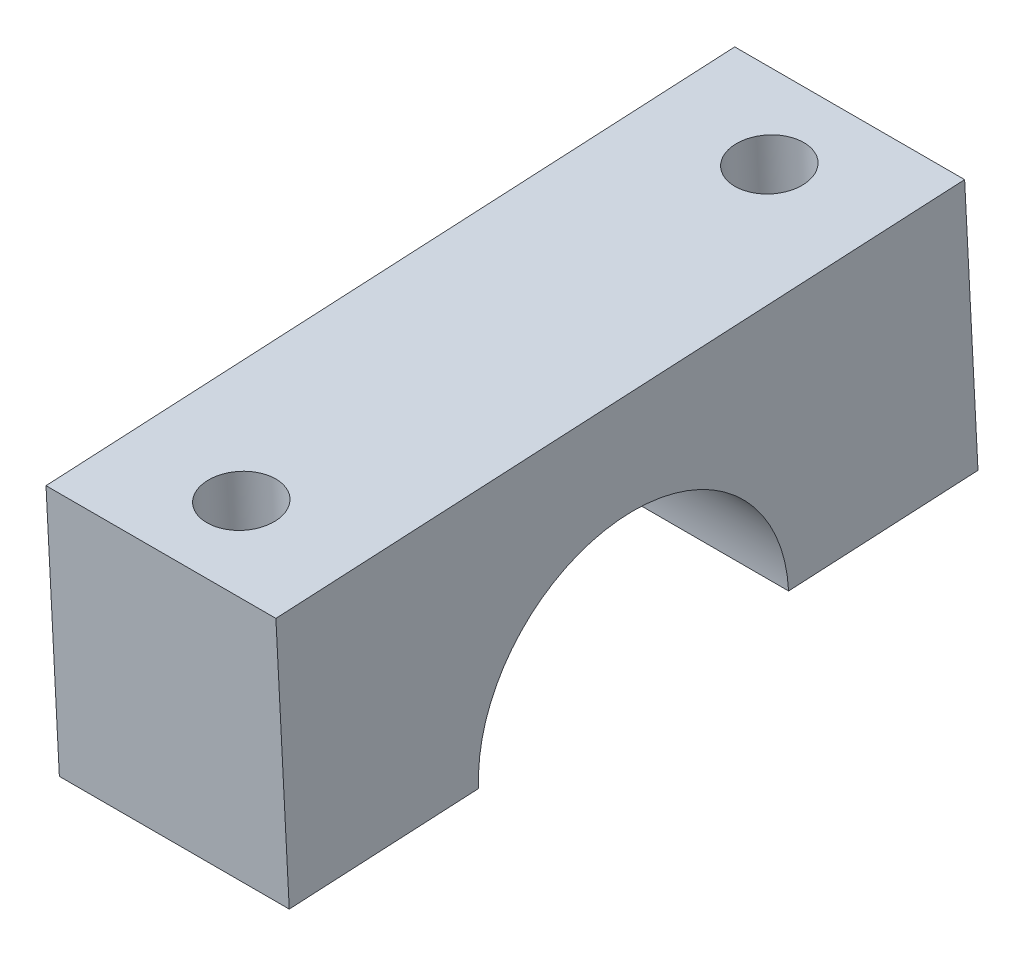
ISO-10303-21;
HEADER;
FILE_DESCRIPTION(('STEP AP214'),'2;1');
FILE_NAME('part.step','',(''),(''),'','','');
FILE_SCHEMA(('AUTOMOTIVE_DESIGN { 1 0 10303 214 1 1 1 1 }'));
ENDSEC;
DATA;
#1=APPLICATION_CONTEXT('core data for automotive mechanical design processes');
#2=APPLICATION_PROTOCOL_DEFINITION('international standard','automotive_design',2000,#1);
#3=PRODUCT_CONTEXT('',#1,'mechanical');
#4=PRODUCT('Part','Part','',(#3));
#5=PRODUCT_RELATED_PRODUCT_CATEGORY('part','',(#4));
#6=PRODUCT_DEFINITION_FORMATION('','',#4);
#7=PRODUCT_DEFINITION_CONTEXT('part definition',#1,'design');
#8=PRODUCT_DEFINITION('design','',#6,#7);
#9=PRODUCT_DEFINITION_SHAPE('','',#8);
#10=(LENGTH_UNIT() NAMED_UNIT(*) SI_UNIT(.MILLI.,.METRE.));
#11=(NAMED_UNIT(*) PLANE_ANGLE_UNIT() SI_UNIT($,.RADIAN.));
#12=(NAMED_UNIT(*) SI_UNIT($,.STERADIAN.) SOLID_ANGLE_UNIT());
#13=UNCERTAINTY_MEASURE_WITH_UNIT(LENGTH_MEASURE(1.E-05),#10,'distance_accuracy_value','');
#14=(GEOMETRIC_REPRESENTATION_CONTEXT(3) GLOBAL_UNCERTAINTY_ASSIGNED_CONTEXT((#13)) GLOBAL_UNIT_ASSIGNED_CONTEXT((#10,
#11,#12)) REPRESENTATION_CONTEXT('',''));
#15=CARTESIAN_POINT('',(0.,0.,0.));
#16=DIRECTION('',(0.,0.,1.));
#17=DIRECTION('',(1.,0.,0.));
#18=AXIS2_PLACEMENT_3D('',#15,#16,#17);
#19=CARTESIAN_POINT('',(20.,180.86438591394,3958.59296353033));
#20=DIRECTION('',(0.,0.998664984942108,0.0516550854280407));
#21=DIRECTION('',(0.,-0.0516550854280407,0.998664984942109));
#22=AXIS2_PLACEMENT_3D('',#19,#20,#21);
#23=PLANE('',#22);
#24=CARTESIAN_POINT('',(10.,180.502800315943,3965.58361842493));
#25=DIRECTION('',(0.,0.998664984942108,0.0516550854280407));
#26=DIRECTION('',(0.,-0.0516550854280407,0.998664984942109));
#27=AXIS2_PLACEMENT_3D('',#24,#25,#26);
#28=CIRCLE('',#27,2.99999999999968);
#29=CARTESIAN_POINT('',(10.,180.347835059659,3968.57961337975));
#30=VERTEX_POINT('',#29);
#31=EDGE_CURVE('E131',#30,#30,#28,.F.);
#32=ORIENTED_EDGE('',*,*,#31,.F.);
#33=EDGE_LOOP('',(#32));
#34=FACE_BOUND('',#33,.T.);
#35=DIRECTION('',(0.,0.0516550854280407,-0.998664984942108));
#36=VECTOR('',#35,1.);
#37=CARTESIAN_POINT('',(20.,180.86438591394,3958.59296353033));
#38=LINE('',#37,#36);
#39=CARTESIAN_POINT('',(20.,180.012077004377,3975.07093578188));
#40=VERTEX_POINT('',#39);
#41=CARTESIAN_POINT('',(20.,180.86438591394,3958.59296353033));
#42=VERTEX_POINT('',#41);
#43=EDGE_CURVE('E128',#40,#42,#38,.T.);
#44=ORIENTED_EDGE('',*,*,#43,.F.);
#45=DIRECTION('',(-1.,0.,0.));
#46=VECTOR('',#45,1.);
#47=CARTESIAN_POINT('',(20.,180.012077004377,3975.07093578188));
#48=LINE('',#47,#46);
#49=CARTESIAN_POINT('',(0.,180.012077004377,3975.07093578188));
#50=VERTEX_POINT('',#49);
#51=EDGE_CURVE('E117',#40,#50,#48,.T.);
#52=ORIENTED_EDGE('',*,*,#51,.T.);
#53=DIRECTION('',(0.,0.0516550854280407,-0.998664984942108));
#54=VECTOR('',#53,1.);
#55=CARTESIAN_POINT('',(0.,180.86438591394,3958.59296353033));
#56=LINE('',#55,#54);
#57=CARTESIAN_POINT('',(0.,180.86438591394,3958.59296353033));
#58=VERTEX_POINT('',#57);
#59=EDGE_CURVE('E152',#50,#58,#56,.T.);
#60=ORIENTED_EDGE('',*,*,#59,.T.);
#61=DIRECTION('',(-1.,0.,0.));
#62=VECTOR('',#61,1.);
#63=CARTESIAN_POINT('',(20.,180.86438591394,3958.59296353033));
#64=LINE('',#63,#62);
#65=EDGE_CURVE('E134',#42,#58,#64,.T.);
#66=ORIENTED_EDGE('',*,*,#65,.F.);
#67=EDGE_LOOP('',(#44,#52,#60,#66));
#68=FACE_BOUND('',#67,.T.);
#69=ADVANCED_FACE('F56',(#34,#68),#23,.F.);
#70=CARTESIAN_POINT('',(20.,177.765080788257,4018.51286262686));
#71=DIRECTION('',(0.,0.0516550854280728,-0.998664984942107));
#72=DIRECTION('',(0.,0.998664984942107,0.0516550854280728));
#73=AXIS2_PLACEMENT_3D('',#70,#71,#72);
#74=PLANE('',#73);
#75=DIRECTION('',(0.,-0.998664984942107,-0.0516550854280728));
#76=VECTOR('',#75,1.);
#77=CARTESIAN_POINT('',(0.,177.765080788257,4018.51286262686));
#78=LINE('',#77,#76);
#79=CARTESIAN_POINT('',(0.,200.251606550355,4019.67595878697));
#80=VERTEX_POINT('',#79);
#81=CARTESIAN_POINT('',(0.,177.765080788257,4018.51286262686));
#82=VERTEX_POINT('',#81);
#83=EDGE_CURVE('E125',#80,#82,#78,.T.);
#84=ORIENTED_EDGE('',*,*,#83,.T.);
#85=DIRECTION('',(-1.,0.,0.));
#86=VECTOR('',#85,1.);
#87=CARTESIAN_POINT('',(20.,177.765080788257,4018.51286262686));
#88=LINE('',#87,#86);
#89=CARTESIAN_POINT('',(20.,177.765080788257,4018.51286262686));
#90=VERTEX_POINT('',#89);
#91=EDGE_CURVE('E65',#90,#82,#88,.T.);
#92=ORIENTED_EDGE('',*,*,#91,.F.);
#93=DIRECTION('',(0.,-0.998664984942107,-0.0516550854280728));
#94=VECTOR('',#93,1.);
#95=CARTESIAN_POINT('',(20.,177.765080788257,4018.51286262686));
#96=LINE('',#95,#94);
#97=CARTESIAN_POINT('',(20.,200.251606550355,4019.67595878697));
#98=VERTEX_POINT('',#97);
#99=EDGE_CURVE('E137',#98,#90,#96,.T.);
#100=ORIENTED_EDGE('',*,*,#99,.F.);
#101=DIRECTION('',(-1.,0.,0.));
#102=VECTOR('',#101,1.);
#103=CARTESIAN_POINT('',(20.,200.251606550355,4019.67595878697));
#104=LINE('',#103,#102);
#105=EDGE_CURVE('E148',#98,#80,#104,.T.);
#106=ORIENTED_EDGE('',*,*,#105,.T.);
#107=EDGE_LOOP('',(#84,#92,#100,#106));
#108=FACE_BOUND('',#107,.T.);
#109=ADVANCED_FACE('F58',(#108),#74,.F.);
#110=CARTESIAN_POINT('',(10.,178.126666386253,4011.52220773227));
#111=DIRECTION('',(0.,0.998664984942108,0.0516550854280407));
#112=DIRECTION('',(0.,-0.0516550854280407,0.998664984942109));
#113=AXIS2_PLACEMENT_3D('',#110,#111,#112);
#114=CIRCLE('',#113,2.99999999999968);
#115=CARTESIAN_POINT('',(10.,177.971701129969,4014.5182026871));
#116=VERTEX_POINT('',#115);
#117=EDGE_CURVE('E187',#116,#116,#114,.T.);
#118=ORIENTED_EDGE('',*,*,#117,.T.);
#119=EDGE_LOOP('',(#118));
#120=FACE_BOUND('',#119,.T.);
#121=CARTESIAN_POINT('',(0.,178.61738969782,4002.03489037531));
#122=VERTEX_POINT('',#121);
#123=EDGE_CURVE('E153',#82,#122,#56,.T.);
#124=ORIENTED_EDGE('',*,*,#123,.T.);
#125=DIRECTION('',(-1.,0.,0.));
#126=VECTOR('',#125,1.);
#127=CARTESIAN_POINT('',(20.,178.61738969782,4002.03489037531));
#128=LINE('',#127,#126);
#129=CARTESIAN_POINT('',(20.,178.61738969782,4002.03489037531));
#130=VERTEX_POINT('',#129);
#131=EDGE_CURVE('E71',#122,#130,#128,.F.);
#132=ORIENTED_EDGE('',*,*,#131,.T.);
#133=EDGE_CURVE('E108',#90,#130,#38,.T.);
#134=ORIENTED_EDGE('',*,*,#133,.F.);
#135=ORIENTED_EDGE('',*,*,#91,.T.);
#136=EDGE_LOOP('',(#124,#132,#134,#135));
#137=FACE_BOUND('',#136,.T.);
#138=ADVANCED_FACE('F170',(#120,#137),#23,.F.);
#139=CARTESIAN_POINT('',(20.,203.350911676037,3959.75605969044));
#140=DIRECTION('',(0.,-0.0516550854280136,0.99866498494211));
#141=DIRECTION('',(0.,-0.99866498494211,-0.0516550854280136));
#142=AXIS2_PLACEMENT_3D('',#139,#140,#141);
#143=PLANE('',#142);
#144=DIRECTION('',(0.,0.99866498494211,0.0516550854280136));
#145=VECTOR('',#144,1.);
#146=CARTESIAN_POINT('',(0.,203.350911676037,3959.75605969044));
#147=LINE('',#146,#145);
#148=CARTESIAN_POINT('',(0.,203.350911676037,3959.75605969044));
#149=VERTEX_POINT('',#148);
#150=EDGE_CURVE('E157',#58,#149,#147,.T.);
#151=ORIENTED_EDGE('',*,*,#150,.T.);
#152=DIRECTION('',(-1.,0.,0.));
#153=VECTOR('',#152,1.);
#154=CARTESIAN_POINT('',(20.,203.350911676037,3959.75605969044));
#155=LINE('',#154,#153);
#156=CARTESIAN_POINT('',(20.,203.350911676037,3959.75605969044));
#157=VERTEX_POINT('',#156);
#158=EDGE_CURVE('E164',#157,#149,#155,.T.);
#159=ORIENTED_EDGE('',*,*,#158,.F.);
#160=DIRECTION('',(0.,0.99866498494211,0.0516550854280136));
#161=VECTOR('',#160,1.);
#162=CARTESIAN_POINT('',(20.,203.350911676037,3959.75605969044));
#163=LINE('',#162,#161);
#164=EDGE_CURVE('E141',#42,#157,#163,.T.);
#165=ORIENTED_EDGE('',*,*,#164,.F.);
#166=ORIENTED_EDGE('',*,*,#65,.T.);
#167=EDGE_LOOP('',(#151,#159,#165,#166));
#168=FACE_BOUND('',#167,.T.);
#169=ADVANCED_FACE('F219',(#168),#143,.F.);
#170=CARTESIAN_POINT('',(20.,200.251606550355,4019.67595878697));
#171=DIRECTION('',(0.,-0.998664984942109,-0.0516550854280405));
#172=DIRECTION('',(0.,0.0516550854280405,-0.998664984942109));
#173=AXIS2_PLACEMENT_3D('',#170,#171,#172);
#174=PLANE('',#173);
#175=CARTESIAN_POINT('',(10.,200.613192148351,4012.68530389238));
#176=DIRECTION('',(0.,-0.998664984942109,-0.0516550854280461));
#177=DIRECTION('',(0.,0.051655085428046,-0.998664984942108));
#178=AXIS2_PLACEMENT_3D('',#175,#176,#177);
#179=CIRCLE('',#178,2.99999999999968);
#180=CARTESIAN_POINT('',(10.,200.768157404635,4009.68930893755));
#181=VERTEX_POINT('',#180);
#182=EDGE_CURVE('E191',#181,#181,#179,.T.);
#183=ORIENTED_EDGE('',*,*,#182,.T.);
#184=EDGE_LOOP('',(#183));
#185=FACE_BOUND('',#184,.T.);
#186=CARTESIAN_POINT('',(10.,202.989326078041,3966.74671458504));
#187=DIRECTION('',(0.,0.998664984942109,0.0516550854280405));
#188=DIRECTION('',(0.,-0.0516550854280405,0.998664984942109));
#189=AXIS2_PLACEMENT_3D('',#186,#187,#188);
#190=CIRCLE('',#189,2.99999999999968);
#191=CARTESIAN_POINT('',(10.,202.834360821757,3969.74270953986));
#192=VERTEX_POINT('',#191);
#193=EDGE_CURVE('E183',#192,#192,#190,.T.);
#194=ORIENTED_EDGE('',*,*,#193,.F.);
#195=EDGE_LOOP('',(#194));
#196=FACE_BOUND('',#195,.T.);
#197=DIRECTION('',(0.,-0.0516550854280405,0.998664984942109));
#198=VECTOR('',#197,1.);
#199=CARTESIAN_POINT('',(0.,200.251606550355,4019.67595878697));
#200=LINE('',#199,#198);
#201=EDGE_CURVE('E101',#149,#80,#200,.T.);
#202=ORIENTED_EDGE('',*,*,#201,.T.);
#203=ORIENTED_EDGE('',*,*,#105,.F.);
#204=DIRECTION('',(0.,-0.0516550854280405,0.998664984942109));
#205=VECTOR('',#204,1.);
#206=CARTESIAN_POINT('',(20.,200.251606550355,4019.67595878697));
#207=LINE('',#206,#205);
#208=EDGE_CURVE('E80',#157,#98,#207,.T.);
#209=ORIENTED_EDGE('',*,*,#208,.F.);
#210=ORIENTED_EDGE('',*,*,#158,.T.);
#211=EDGE_LOOP('',(#202,#203,#209,#210));
#212=FACE_BOUND('',#211,.T.);
#213=ADVANCED_FACE('F197',(#185,#196,#212),#174,.F.);
#214=CARTESIAN_POINT('',(20.,0.,0.));
#215=DIRECTION('',(-1.,0.,0.));
#216=DIRECTION('',(0.,0.,1.));
#217=AXIS2_PLACEMENT_3D('',#214,#215,#216);
#218=PLANE('',#217);
#219=ORIENTED_EDGE('',*,*,#133,.T.);
#220=CARTESIAN_POINT('',(20.,179.314733351098,3988.5529130786));
#221=DIRECTION('',(-1.,0.,0.));
#222=DIRECTION('',(0.,0.,1.));
#223=AXIS2_PLACEMENT_3D('',#220,#221,#222);
#224=CIRCLE('',#223,13.4999999999998);
#225=EDGE_CURVE('E120',#130,#40,#224,.T.);
#226=ORIENTED_EDGE('',*,*,#225,.T.);
#227=ORIENTED_EDGE('',*,*,#43,.T.);
#228=ORIENTED_EDGE('',*,*,#164,.T.);
#229=ORIENTED_EDGE('',*,*,#208,.T.);
#230=ORIENTED_EDGE('',*,*,#99,.T.);
#231=EDGE_LOOP('',(#219,#226,#227,#228,#229,#230));
#232=FACE_BOUND('',#231,.T.);
#233=ADVANCED_FACE('F127',(#232),#218,.F.);
#234=CARTESIAN_POINT('',(0.,0.,0.));
#235=DIRECTION('',(-1.,0.,0.));
#236=DIRECTION('',(0.,0.,1.));
#237=AXIS2_PLACEMENT_3D('',#234,#235,#236);
#238=PLANE('',#237);
#239=CARTESIAN_POINT('',(0.,179.314733351098,3988.5529130786));
#240=DIRECTION('',(-1.,0.,0.));
#241=DIRECTION('',(0.,0.,1.));
#242=AXIS2_PLACEMENT_3D('',#239,#240,#241);
#243=CIRCLE('',#242,13.4999999999998);
#244=EDGE_CURVE('E12',#122,#50,#243,.T.);
#245=ORIENTED_EDGE('',*,*,#244,.F.);
#246=ORIENTED_EDGE('',*,*,#123,.F.);
#247=ORIENTED_EDGE('',*,*,#83,.F.);
#248=ORIENTED_EDGE('',*,*,#201,.F.);
#249=ORIENTED_EDGE('',*,*,#150,.F.);
#250=ORIENTED_EDGE('',*,*,#59,.F.);
#251=EDGE_LOOP('',(#245,#246,#247,#248,#249,#250));
#252=FACE_BOUND('',#251,.T.);
#253=ADVANCED_FACE('F175',(#252),#238,.T.);
#254=CARTESIAN_POINT('',(20.,179.314733351098,3988.5529130786));
#255=DIRECTION('',(-1.,0.,0.));
#256=DIRECTION('',(0.,0.,1.));
#257=AXIS2_PLACEMENT_3D('',#254,#255,#256);
#258=CYLINDRICAL_SURFACE('',#257,13.4999999999998);
#259=ORIENTED_EDGE('',*,*,#225,.F.);
#260=ORIENTED_EDGE('',*,*,#131,.F.);
#261=ORIENTED_EDGE('',*,*,#244,.T.);
#262=ORIENTED_EDGE('',*,*,#51,.F.);
#263=EDGE_LOOP('',(#259,#260,#261,#262));
#264=FACE_BOUND('',#263,.T.);
#265=ADVANCED_FACE('F119',(#264),#258,.F.);
#266=CARTESIAN_POINT('',(10.,172.028846920111,3965.14531049066));
#267=DIRECTION('',(0.,0.998664984942109,0.0516550854280405));
#268=DIRECTION('',(0.,-0.0516550854280405,0.998664984942109));
#269=AXIS2_PLACEMENT_3D('',#266,#267,#268);
#270=CYLINDRICAL_SURFACE('',#269,2.99999999999968);
#271=ORIENTED_EDGE('',*,*,#31,.T.);
#272=EDGE_LOOP('',(#271));
#273=FACE_BOUND('',#272,.T.);
#274=ORIENTED_EDGE('',*,*,#193,.T.);
#275=EDGE_LOOP('',(#274));
#276=FACE_BOUND('',#275,.T.);
#277=ADVANCED_FACE('F202',(#273,#276),#270,.F.);
#278=CARTESIAN_POINT('',(10.,169.65271299042,4011.083899798));
#279=DIRECTION('',(0.,0.998664984942108,0.051655085428046));
#280=DIRECTION('',(0.,-0.051655085428046,0.998664984942108));
#281=AXIS2_PLACEMENT_3D('',#278,#279,#280);
#282=CYLINDRICAL_SURFACE('',#281,2.99999999999968);
#283=ORIENTED_EDGE('',*,*,#117,.F.);
#284=EDGE_LOOP('',(#283));
#285=FACE_BOUND('',#284,.T.);
#286=ORIENTED_EDGE('',*,*,#182,.F.);
#287=EDGE_LOOP('',(#286));
#288=FACE_BOUND('',#287,.T.);
#289=ADVANCED_FACE('F200',(#285,#288),#282,.F.);
#290=CLOSED_SHELL('',(#69,#109,#138,#169,#213,#233,#253,#265,#277,#289));
#291=MANIFOLD_SOLID_BREP('B2',#290);
#292=ADVANCED_BREP_SHAPE_REPRESENTATION('',(#18,#291),#14);
#293=SHAPE_DEFINITION_REPRESENTATION(#9,#292);
ENDSEC;
END-ISO-10303-21;
